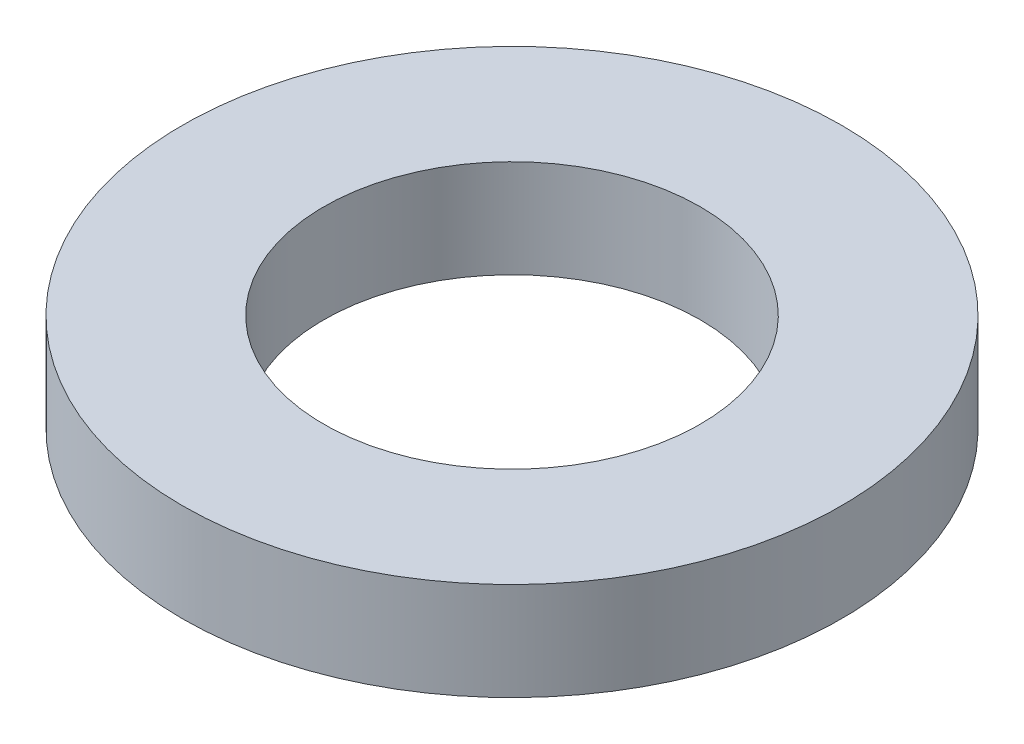
ISO-10303-21;
HEADER;
FILE_DESCRIPTION(('STEP AP214'),'2;1');
FILE_NAME('part.step','',(''),(''),'','','');
FILE_SCHEMA(('AUTOMOTIVE_DESIGN { 1 0 10303 214 1 1 1 1 }'));
ENDSEC;
DATA;
#1=APPLICATION_CONTEXT('core data for automotive mechanical design processes');
#2=APPLICATION_PROTOCOL_DEFINITION('international standard','automotive_design',2000,#1);
#3=PRODUCT_CONTEXT('',#1,'mechanical');
#4=PRODUCT('Part','Part','',(#3));
#5=PRODUCT_RELATED_PRODUCT_CATEGORY('part','',(#4));
#6=PRODUCT_DEFINITION_FORMATION('','',#4);
#7=PRODUCT_DEFINITION_CONTEXT('part definition',#1,'design');
#8=PRODUCT_DEFINITION('design','',#6,#7);
#9=PRODUCT_DEFINITION_SHAPE('','',#8);
#10=(LENGTH_UNIT() NAMED_UNIT(*) SI_UNIT(.MILLI.,.METRE.));
#11=(NAMED_UNIT(*) PLANE_ANGLE_UNIT() SI_UNIT($,.RADIAN.));
#12=(NAMED_UNIT(*) SI_UNIT($,.STERADIAN.) SOLID_ANGLE_UNIT());
#13=UNCERTAINTY_MEASURE_WITH_UNIT(LENGTH_MEASURE(1.E-05),#10,'distance_accuracy_value','');
#14=(GEOMETRIC_REPRESENTATION_CONTEXT(3) GLOBAL_UNCERTAINTY_ASSIGNED_CONTEXT((#13)) GLOBAL_UNIT_ASSIGNED_CONTEXT((#10,
#11,#12)) REPRESENTATION_CONTEXT('',''));
#15=CARTESIAN_POINT('',(0.,0.,0.));
#16=DIRECTION('',(0.,0.,1.));
#17=DIRECTION('',(1.,0.,0.));
#18=AXIS2_PLACEMENT_3D('',#15,#16,#17);
#19=CARTESIAN_POINT('',(0.,26.,0.));
#20=DIRECTION('',(0.,-1.,0.));
#21=DIRECTION('',(0.,0.,-1.));
#22=AXIS2_PLACEMENT_3D('',#19,#20,#21);
#23=CYLINDRICAL_SURFACE('',#22,87.5);
#24=CARTESIAN_POINT('',(0.,26.,0.));
#25=DIRECTION('',(0.,1.,0.));
#26=DIRECTION('',(0.,0.,1.));
#27=AXIS2_PLACEMENT_3D('',#24,#25,#26);
#28=CIRCLE('',#27,87.5);
#29=CARTESIAN_POINT('',(0.,26.,-87.5));
#30=VERTEX_POINT('',#29);
#31=EDGE_CURVE('E10',#30,#30,#28,.T.);
#32=CARTESIAN_POINT('',(0.,0.,0.));
#33=DIRECTION('',(0.,1.,0.));
#34=DIRECTION('',(0.,0.,1.));
#35=AXIS2_PLACEMENT_3D('',#32,#33,#34);
#36=CIRCLE('',#35,87.5);
#37=CARTESIAN_POINT('',(0.,0.,-87.5));
#38=VERTEX_POINT('',#37);
#39=EDGE_CURVE('E37',#38,#38,#36,.T.);
#40=CARTESIAN_POINT('',(0.,26.,-87.5));
#41=CARTESIAN_POINT('',(0.,25.7291666666667,-87.5));
#42=CARTESIAN_POINT('',(0.,25.4583333333333,-87.5));
#43=CARTESIAN_POINT('',(0.,24.9166666666667,-87.5));
#44=CARTESIAN_POINT('',(0.,24.6458333333333,-87.5));
#45=CARTESIAN_POINT('',(0.,24.1041666666667,-87.5));
#46=CARTESIAN_POINT('',(0.,23.8333333333333,-87.5));
#47=CARTESIAN_POINT('',(0.,23.2916666666667,-87.5));
#48=CARTESIAN_POINT('',(0.,23.0208333333333,-87.5));
#49=CARTESIAN_POINT('',(0.,22.4791666666667,-87.5));
#50=CARTESIAN_POINT('',(0.,22.2083333333333,-87.5));
#51=CARTESIAN_POINT('',(0.,21.6666666666667,-87.5));
#52=CARTESIAN_POINT('',(0.,21.3958333333333,-87.5));
#53=CARTESIAN_POINT('',(0.,20.8541666666667,-87.5));
#54=CARTESIAN_POINT('',(0.,20.5833333333333,-87.5));
#55=CARTESIAN_POINT('',(0.,20.0416666666667,-87.5));
#56=CARTESIAN_POINT('',(0.,19.7708333333333,-87.5));
#57=CARTESIAN_POINT('',(0.,19.2291666666667,-87.5));
#58=CARTESIAN_POINT('',(0.,18.9583333333333,-87.5));
#59=CARTESIAN_POINT('',(0.,18.4166666666667,-87.5));
#60=CARTESIAN_POINT('',(0.,18.1458333333333,-87.5));
#61=CARTESIAN_POINT('',(0.,17.6041666666667,-87.5));
#62=CARTESIAN_POINT('',(0.,17.3333333333333,-87.5));
#63=CARTESIAN_POINT('',(0.,16.7916666666667,-87.5));
#64=CARTESIAN_POINT('',(0.,16.5208333333333,-87.5));
#65=CARTESIAN_POINT('',(0.,15.9791666666667,-87.5));
#66=CARTESIAN_POINT('',(0.,15.7083333333333,-87.5));
#67=CARTESIAN_POINT('',(0.,15.1666666666667,-87.5));
#68=CARTESIAN_POINT('',(0.,14.8958333333333,-87.5));
#69=CARTESIAN_POINT('',(0.,14.3541666666667,-87.5));
#70=CARTESIAN_POINT('',(0.,14.0833333333333,-87.5));
#71=CARTESIAN_POINT('',(0.,13.5416666666667,-87.5));
#72=CARTESIAN_POINT('',(0.,13.2708333333333,-87.5));
#73=CARTESIAN_POINT('',(0.,12.7291666666667,-87.5));
#74=CARTESIAN_POINT('',(0.,12.4583333333333,-87.5));
#75=CARTESIAN_POINT('',(0.,11.9166666666667,-87.5));
#76=CARTESIAN_POINT('',(0.,11.6458333333333,-87.5));
#77=CARTESIAN_POINT('',(0.,11.1041666666667,-87.5));
#78=CARTESIAN_POINT('',(0.,10.8333333333333,-87.5));
#79=CARTESIAN_POINT('',(0.,10.2916666666667,-87.5));
#80=CARTESIAN_POINT('',(0.,10.0208333333333,-87.5));
#81=CARTESIAN_POINT('',(0.,9.47916666666667,-87.5));
#82=CARTESIAN_POINT('',(0.,9.20833333333333,-87.5));
#83=CARTESIAN_POINT('',(0.,8.66666666666667,-87.5));
#84=CARTESIAN_POINT('',(0.,8.39583333333333,-87.5));
#85=CARTESIAN_POINT('',(0.,7.85416666666667,-87.5));
#86=CARTESIAN_POINT('',(0.,7.58333333333333,-87.5));
#87=CARTESIAN_POINT('',(0.,7.04166666666667,-87.5));
#88=CARTESIAN_POINT('',(0.,6.77083333333333,-87.5));
#89=CARTESIAN_POINT('',(0.,6.22916666666667,-87.5));
#90=CARTESIAN_POINT('',(0.,5.95833333333333,-87.5));
#91=CARTESIAN_POINT('',(0.,5.41666666666667,-87.5));
#92=CARTESIAN_POINT('',(0.,5.14583333333333,-87.5));
#93=CARTESIAN_POINT('',(0.,4.60416666666667,-87.5));
#94=CARTESIAN_POINT('',(0.,4.33333333333333,-87.5));
#95=CARTESIAN_POINT('',(0.,3.79166666666667,-87.5));
#96=CARTESIAN_POINT('',(0.,3.52083333333333,-87.5));
#97=CARTESIAN_POINT('',(0.,2.97916666666667,-87.5));
#98=CARTESIAN_POINT('',(0.,2.70833333333333,-87.5));
#99=CARTESIAN_POINT('',(0.,2.16666666666667,-87.5));
#100=CARTESIAN_POINT('',(0.,1.89583333333333,-87.5));
#101=CARTESIAN_POINT('',(0.,1.35416666666667,-87.5));
#102=CARTESIAN_POINT('',(0.,1.08333333333333,-87.5));
#103=CARTESIAN_POINT('',(0.,0.541666666666667,-87.5));
#104=CARTESIAN_POINT('',(0.,0.270833333333334,-87.5));
#105=CARTESIAN_POINT('',(0.,0.,-87.5));
#106=B_SPLINE_CURVE_WITH_KNOTS('',3,(#40,#41,#42,#43,#44,#45,#46,#47,#48,#49,#50,#51,#52,#53,
#54,#55,#56,#57,#58,#59,#60,#61,#62,#63,#64,#65,#66,#67,#68,#69,#70,#71,#72,#73,#74,#75,#76,#77,
#78,#79,#80,#81,#82,#83,#84,#85,#86,#87,#88,#89,#90,#91,#92,#93,#94,#95,#96,#97,#98,#99,#100,
#101,#102,#103,#104,#105),.UNSPECIFIED.,.F.,.F.,(4,2,2,2,2,2,2,2,2,2,2,2,2,2,2,2,2,2,2,2,2,2,2,
2,2,2,2,2,2,2,2,2,4),(0.,0.812500000000001,1.625,2.4375,3.25,4.0625,4.875,5.6875,6.5,7.3125,
8.125,8.9375,9.75,10.5625,11.375,12.1875,13.,13.8125,14.625,15.4375,16.25,17.0625,17.875,
18.6875,19.5,20.3125,21.125,21.9375,22.75,23.5625,24.375,25.1875,26.),.UNSPECIFIED.);
#107=EDGE_CURVE('BSEAM40',#30,#38,#106,.T.);
#108=ORIENTED_EDGE('',*,*,#31,.F.);
#109=ORIENTED_EDGE('',*,*,#39,.T.);
#110=ORIENTED_EDGE('',*,*,#107,.T.);
#111=ORIENTED_EDGE('',*,*,#107,.F.);
#112=EDGE_LOOP('',(#108,#110,#109,#111));
#113=FACE_BOUND('',#112,.T.);
#114=ADVANCED_FACE('F40',(#113),#23,.T.);
#115=CARTESIAN_POINT('',(0.,26.,0.));
#116=DIRECTION('',(0.,1.,0.));
#117=DIRECTION('',(0.,0.,1.));
#118=AXIS2_PLACEMENT_3D('',#115,#116,#117);
#119=PLANE('',#118);
#120=CARTESIAN_POINT('',(0.,26.,0.));
#121=DIRECTION('',(0.,1.,0.));
#122=DIRECTION('',(0.,0.,1.));
#123=AXIS2_PLACEMENT_3D('',#120,#121,#122);
#124=CIRCLE('',#123,50.);
#125=CARTESIAN_POINT('',(0.,26.,-50.));
#126=VERTEX_POINT('',#125);
#127=EDGE_CURVE('E50',#126,#126,#124,.T.);
#128=ORIENTED_EDGE('',*,*,#127,.F.);
#129=EDGE_LOOP('',(#128));
#130=FACE_BOUND('',#129,.T.);
#131=ORIENTED_EDGE('',*,*,#31,.T.);
#132=EDGE_LOOP('',(#131));
#133=FACE_BOUND('',#132,.T.);
#134=ADVANCED_FACE('F59',(#130,#133),#119,.T.);
#135=CARTESIAN_POINT('',(0.,0.,0.));
#136=DIRECTION('',(0.,1.,0.));
#137=DIRECTION('',(0.,0.,1.));
#138=AXIS2_PLACEMENT_3D('',#135,#136,#137);
#139=PLANE('',#138);
#140=CARTESIAN_POINT('',(0.,0.,0.));
#141=DIRECTION('',(0.,1.,0.));
#142=DIRECTION('',(0.,0.,1.));
#143=AXIS2_PLACEMENT_3D('',#140,#141,#142);
#144=CIRCLE('',#143,50.);
#145=CARTESIAN_POINT('',(0.,0.,-50.));
#146=VERTEX_POINT('',#145);
#147=EDGE_CURVE('E47',#146,#146,#144,.T.);
#148=ORIENTED_EDGE('',*,*,#147,.T.);
#149=EDGE_LOOP('',(#148));
#150=FACE_BOUND('',#149,.T.);
#151=ORIENTED_EDGE('',*,*,#39,.F.);
#152=EDGE_LOOP('',(#151));
#153=FACE_BOUND('',#152,.T.);
#154=ADVANCED_FACE('F58',(#150,#153),#139,.F.);
#155=CARTESIAN_POINT('',(0.,26.,0.));
#156=DIRECTION('',(0.,-1.,0.));
#157=DIRECTION('',(0.,0.,-1.));
#158=AXIS2_PLACEMENT_3D('',#155,#156,#157);
#159=CYLINDRICAL_SURFACE('',#158,50.);
#160=CARTESIAN_POINT('',(0.,26.,-50.));
#161=CARTESIAN_POINT('',(0.,25.7291666666667,-50.));
#162=CARTESIAN_POINT('',(0.,25.4583333333333,-50.));
#163=CARTESIAN_POINT('',(0.,24.9166666666667,-50.));
#164=CARTESIAN_POINT('',(0.,24.6458333333333,-50.));
#165=CARTESIAN_POINT('',(0.,24.1041666666667,-50.));
#166=CARTESIAN_POINT('',(0.,23.8333333333333,-50.));
#167=CARTESIAN_POINT('',(0.,23.2916666666667,-50.));
#168=CARTESIAN_POINT('',(0.,23.0208333333333,-50.));
#169=CARTESIAN_POINT('',(0.,22.4791666666667,-50.));
#170=CARTESIAN_POINT('',(0.,22.2083333333333,-50.));
#171=CARTESIAN_POINT('',(0.,21.6666666666667,-50.));
#172=CARTESIAN_POINT('',(0.,21.3958333333333,-50.));
#173=CARTESIAN_POINT('',(0.,20.8541666666667,-50.));
#174=CARTESIAN_POINT('',(0.,20.5833333333333,-50.));
#175=CARTESIAN_POINT('',(0.,20.0416666666667,-50.));
#176=CARTESIAN_POINT('',(0.,19.7708333333333,-50.));
#177=CARTESIAN_POINT('',(0.,19.2291666666667,-50.));
#178=CARTESIAN_POINT('',(0.,18.9583333333333,-50.));
#179=CARTESIAN_POINT('',(0.,18.4166666666667,-50.));
#180=CARTESIAN_POINT('',(0.,18.1458333333333,-50.));
#181=CARTESIAN_POINT('',(0.,17.6041666666667,-50.));
#182=CARTESIAN_POINT('',(0.,17.3333333333333,-50.));
#183=CARTESIAN_POINT('',(0.,16.7916666666667,-50.));
#184=CARTESIAN_POINT('',(0.,16.5208333333333,-50.));
#185=CARTESIAN_POINT('',(0.,15.9791666666667,-50.));
#186=CARTESIAN_POINT('',(0.,15.7083333333333,-50.));
#187=CARTESIAN_POINT('',(0.,15.1666666666667,-50.));
#188=CARTESIAN_POINT('',(0.,14.8958333333333,-50.));
#189=CARTESIAN_POINT('',(0.,14.3541666666667,-50.));
#190=CARTESIAN_POINT('',(0.,14.0833333333333,-50.));
#191=CARTESIAN_POINT('',(0.,13.5416666666667,-50.));
#192=CARTESIAN_POINT('',(0.,13.2708333333333,-50.));
#193=CARTESIAN_POINT('',(0.,12.7291666666667,-50.));
#194=CARTESIAN_POINT('',(0.,12.4583333333333,-50.));
#195=CARTESIAN_POINT('',(0.,11.9166666666667,-50.));
#196=CARTESIAN_POINT('',(0.,11.6458333333333,-50.));
#197=CARTESIAN_POINT('',(0.,11.1041666666667,-50.));
#198=CARTESIAN_POINT('',(0.,10.8333333333333,-50.));
#199=CARTESIAN_POINT('',(0.,10.2916666666667,-50.));
#200=CARTESIAN_POINT('',(0.,10.0208333333333,-50.));
#201=CARTESIAN_POINT('',(0.,9.47916666666667,-50.));
#202=CARTESIAN_POINT('',(0.,9.20833333333333,-50.));
#203=CARTESIAN_POINT('',(0.,8.66666666666667,-50.));
#204=CARTESIAN_POINT('',(0.,8.39583333333333,-50.));
#205=CARTESIAN_POINT('',(0.,7.85416666666667,-50.));
#206=CARTESIAN_POINT('',(0.,7.58333333333333,-50.));
#207=CARTESIAN_POINT('',(0.,7.04166666666667,-50.));
#208=CARTESIAN_POINT('',(0.,6.77083333333333,-50.));
#209=CARTESIAN_POINT('',(0.,6.22916666666667,-50.));
#210=CARTESIAN_POINT('',(0.,5.95833333333333,-50.));
#211=CARTESIAN_POINT('',(0.,5.41666666666667,-50.));
#212=CARTESIAN_POINT('',(0.,5.14583333333333,-50.));
#213=CARTESIAN_POINT('',(0.,4.60416666666667,-50.));
#214=CARTESIAN_POINT('',(0.,4.33333333333333,-50.));
#215=CARTESIAN_POINT('',(0.,3.79166666666667,-50.));
#216=CARTESIAN_POINT('',(0.,3.52083333333333,-50.));
#217=CARTESIAN_POINT('',(0.,2.97916666666667,-50.));
#218=CARTESIAN_POINT('',(0.,2.70833333333333,-50.));
#219=CARTESIAN_POINT('',(0.,2.16666666666667,-50.));
#220=CARTESIAN_POINT('',(0.,1.89583333333333,-50.));
#221=CARTESIAN_POINT('',(0.,1.35416666666667,-50.));
#222=CARTESIAN_POINT('',(0.,1.08333333333333,-50.));
#223=CARTESIAN_POINT('',(0.,0.541666666666667,-50.));
#224=CARTESIAN_POINT('',(0.,0.270833333333334,-50.));
#225=CARTESIAN_POINT('',(0.,0.,-50.));
#226=B_SPLINE_CURVE_WITH_KNOTS('',3,(#160,#161,#162,#163,#164,#165,#166,#167,#168,#169,#170,
#171,#172,#173,#174,#175,#176,#177,#178,#179,#180,#181,#182,#183,#184,#185,#186,#187,#188,#189,
#190,#191,#192,#193,#194,#195,#196,#197,#198,#199,#200,#201,#202,#203,#204,#205,#206,#207,#208,
#209,#210,#211,#212,#213,#214,#215,#216,#217,#218,#219,#220,#221,#222,#223,#224,#225),
.UNSPECIFIED.,.F.,.F.,(4,2,2,2,2,2,2,2,2,2,2,2,2,2,2,2,2,2,2,2,2,2,2,2,2,2,2,2,2,2,2,2,4),(0.,
0.812499999999997,1.625,2.4375,3.25,4.0625,4.875,5.6875,6.5,7.3125,8.125,8.93749999999999,
9.74999999999999,10.5625,11.375,12.1875,13.,13.8125,14.625,15.4375,16.25,17.0625,17.875,18.6875,
19.5,20.3125,21.125,21.9375,22.75,23.5625,24.375,25.1875,26.),.UNSPECIFIED.);
#227=EDGE_CURVE('BSEAM54',#126,#146,#226,.T.);
#228=ORIENTED_EDGE('',*,*,#127,.T.);
#229=ORIENTED_EDGE('',*,*,#147,.F.);
#230=ORIENTED_EDGE('',*,*,#227,.T.);
#231=ORIENTED_EDGE('',*,*,#227,.F.);
#232=EDGE_LOOP('',(#228,#230,#229,#231));
#233=FACE_BOUND('',#232,.T.);
#234=ADVANCED_FACE('F54',(#233),#159,.F.);
#235=CLOSED_SHELL('',(#114,#134,#154,#234));
#236=MANIFOLD_SOLID_BREP('B2',#235);
#237=ADVANCED_BREP_SHAPE_REPRESENTATION('',(#18,#236),#14);
#238=SHAPE_DEFINITION_REPRESENTATION(#9,#237);
ENDSEC;
END-ISO-10303-21;
